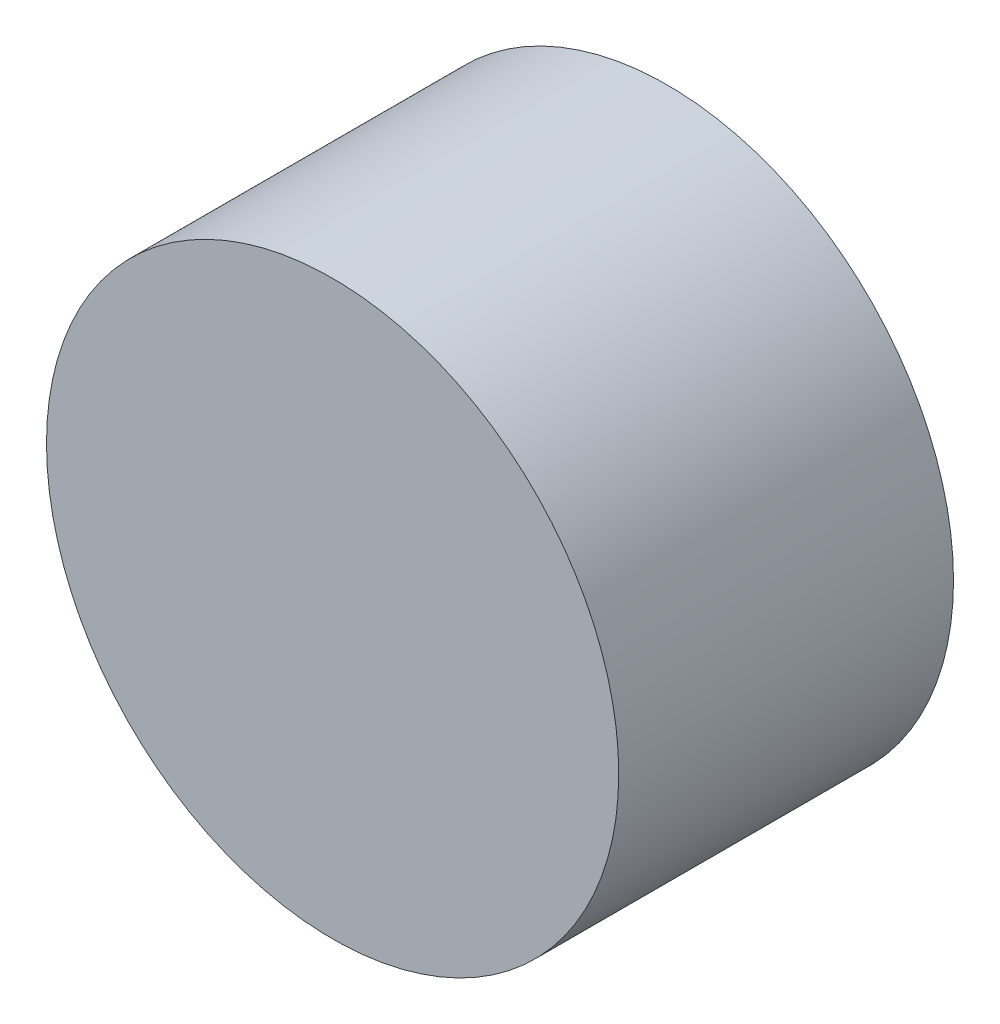
ISO-10303-21;
HEADER;
FILE_DESCRIPTION(('STEP AP214'),'2;1');
FILE_NAME('part.step','',(''),(''),'','','');
FILE_SCHEMA(('AUTOMOTIVE_DESIGN { 1 0 10303 214 1 1 1 1 }'));
ENDSEC;
DATA;
#1=APPLICATION_CONTEXT('core data for automotive mechanical design processes');
#2=APPLICATION_PROTOCOL_DEFINITION('international standard','automotive_design',2000,#1);
#3=PRODUCT_CONTEXT('',#1,'mechanical');
#4=PRODUCT('Part','Part','',(#3));
#5=PRODUCT_RELATED_PRODUCT_CATEGORY('part','',(#4));
#6=PRODUCT_DEFINITION_FORMATION('','',#4);
#7=PRODUCT_DEFINITION_CONTEXT('part definition',#1,'design');
#8=PRODUCT_DEFINITION('design','',#6,#7);
#9=PRODUCT_DEFINITION_SHAPE('','',#8);
#10=(LENGTH_UNIT() NAMED_UNIT(*) SI_UNIT(.MILLI.,.METRE.));
#11=(NAMED_UNIT(*) PLANE_ANGLE_UNIT() SI_UNIT($,.RADIAN.));
#12=(NAMED_UNIT(*) SI_UNIT($,.STERADIAN.) SOLID_ANGLE_UNIT());
#13=UNCERTAINTY_MEASURE_WITH_UNIT(LENGTH_MEASURE(1.E-05),#10,'distance_accuracy_value','');
#14=(GEOMETRIC_REPRESENTATION_CONTEXT(3) GLOBAL_UNCERTAINTY_ASSIGNED_CONTEXT((#13)) GLOBAL_UNIT_ASSIGNED_CONTEXT((#10,
#11,#12)) REPRESENTATION_CONTEXT('',''));
#15=CARTESIAN_POINT('',(0.,0.,0.));
#16=DIRECTION('',(0.,0.,1.));
#17=DIRECTION('',(1.,0.,0.));
#18=AXIS2_PLACEMENT_3D('',#15,#16,#17);
#19=CARTESIAN_POINT('',(0.,0.,24.384));
#20=DIRECTION('',(0.,0.,-1.));
#21=DIRECTION('',(-1.,0.,0.));
#22=AXIS2_PLACEMENT_3D('',#19,#20,#21);
#23=CYLINDRICAL_SURFACE('',#22,20.8407);
#24=CARTESIAN_POINT('',(0.,0.,24.384));
#25=DIRECTION('',(0.,0.,1.));
#26=DIRECTION('',(1.,0.,0.));
#27=AXIS2_PLACEMENT_3D('',#24,#25,#26);
#28=CIRCLE('',#27,20.8407);
#29=CARTESIAN_POINT('',(20.8407,0.,24.384));
#30=VERTEX_POINT('',#29);
#31=EDGE_CURVE('E10',#30,#30,#28,.T.);
#32=ORIENTED_EDGE('',*,*,#31,.F.);
#33=EDGE_LOOP('',(#32));
#34=FACE_BOUND('',#33,.T.);
#35=CARTESIAN_POINT('',(0.,0.,0.));
#36=DIRECTION('',(0.,0.,1.));
#37=DIRECTION('',(1.,0.,0.));
#38=AXIS2_PLACEMENT_3D('',#35,#36,#37);
#39=CIRCLE('',#38,20.8407);
#40=CARTESIAN_POINT('',(20.8407,0.,0.));
#41=VERTEX_POINT('',#40);
#42=EDGE_CURVE('E32',#41,#41,#39,.T.);
#43=ORIENTED_EDGE('',*,*,#42,.T.);
#44=EDGE_LOOP('',(#43));
#45=FACE_BOUND('',#44,.T.);
#46=ADVANCED_FACE('F29',(#34,#45),#23,.T.);
#47=CARTESIAN_POINT('',(0.,0.,24.384));
#48=DIRECTION('',(0.,0.,1.));
#49=DIRECTION('',(1.,0.,0.));
#50=AXIS2_PLACEMENT_3D('',#47,#48,#49);
#51=PLANE('',#50);
#52=ORIENTED_EDGE('',*,*,#31,.T.);
#53=EDGE_LOOP('',(#52));
#54=FACE_BOUND('',#53,.T.);
#55=ADVANCED_FACE('F44',(#54),#51,.T.);
#56=CARTESIAN_POINT('',(0.,0.,0.));
#57=DIRECTION('',(0.,0.,1.));
#58=DIRECTION('',(1.,0.,0.));
#59=AXIS2_PLACEMENT_3D('',#56,#57,#58);
#60=PLANE('',#59);
#61=ORIENTED_EDGE('',*,*,#42,.F.);
#62=EDGE_LOOP('',(#61));
#63=FACE_BOUND('',#62,.T.);
#64=ADVANCED_FACE('F42',(#63),#60,.F.);
#65=CLOSED_SHELL('',(#46,#55,#64));
#66=MANIFOLD_SOLID_BREP('B2',#65);
#67=ADVANCED_BREP_SHAPE_REPRESENTATION('',(#18,#66),#14);
#68=SHAPE_DEFINITION_REPRESENTATION(#9,#67);
ENDSEC;
END-ISO-10303-21;
